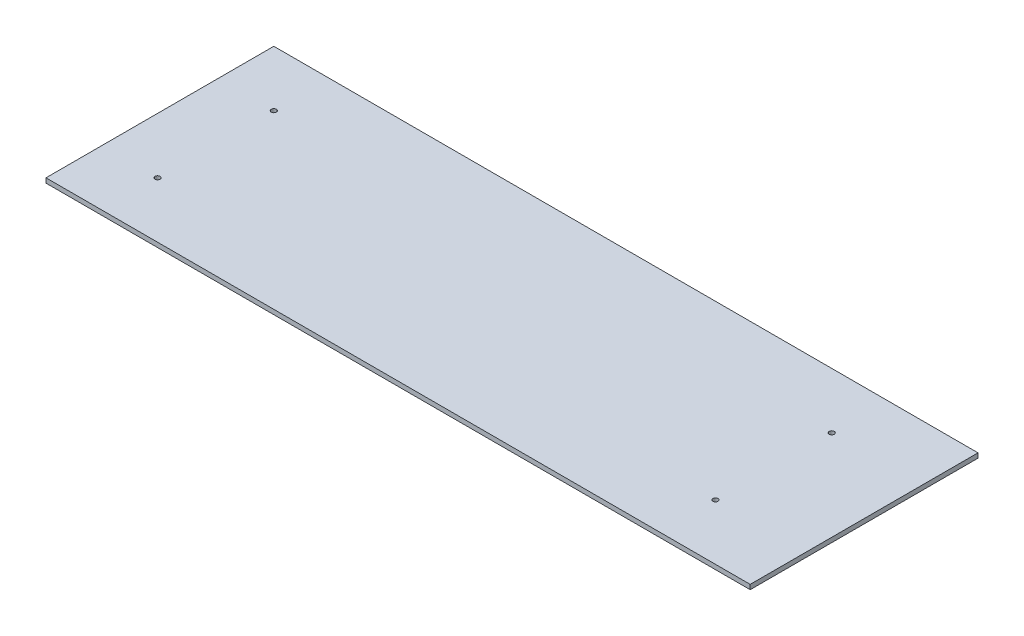
ISO-10303-21;
HEADER;
FILE_DESCRIPTION(('STEP AP214'),'2;1');
FILE_NAME('part.step','',(''),(''),'','','');
FILE_SCHEMA(('AUTOMOTIVE_DESIGN { 1 0 10303 214 1 1 1 1 }'));
ENDSEC;
DATA;
#1=APPLICATION_CONTEXT('core data for automotive mechanical design processes');
#2=APPLICATION_PROTOCOL_DEFINITION('international standard','automotive_design',2000,#1);
#3=PRODUCT_CONTEXT('',#1,'mechanical');
#4=PRODUCT('Part','Part','',(#3));
#5=PRODUCT_RELATED_PRODUCT_CATEGORY('part','',(#4));
#6=PRODUCT_DEFINITION_FORMATION('','',#4);
#7=PRODUCT_DEFINITION_CONTEXT('part definition',#1,'design');
#8=PRODUCT_DEFINITION('design','',#6,#7);
#9=PRODUCT_DEFINITION_SHAPE('','',#8);
#10=(LENGTH_UNIT() NAMED_UNIT(*) SI_UNIT(.MILLI.,.METRE.));
#11=(NAMED_UNIT(*) PLANE_ANGLE_UNIT() SI_UNIT($,.RADIAN.));
#12=(NAMED_UNIT(*) SI_UNIT($,.STERADIAN.) SOLID_ANGLE_UNIT());
#13=UNCERTAINTY_MEASURE_WITH_UNIT(LENGTH_MEASURE(1.E-05),#10,'distance_accuracy_value','');
#14=(GEOMETRIC_REPRESENTATION_CONTEXT(3) GLOBAL_UNCERTAINTY_ASSIGNED_CONTEXT((#13)) GLOBAL_UNIT_ASSIGNED_CONTEXT((#10,
#11,#12)) REPRESENTATION_CONTEXT('',''));
#15=CARTESIAN_POINT('',(0.,0.,0.));
#16=DIRECTION('',(0.,0.,1.));
#17=DIRECTION('',(1.,0.,0.));
#18=AXIS2_PLACEMENT_3D('',#15,#16,#17);
#19=CARTESIAN_POINT('',(0.,6.35,0.));
#20=DIRECTION('',(1.,0.,0.));
#21=DIRECTION('',(0.,0.,-1.));
#22=AXIS2_PLACEMENT_3D('',#19,#20,#21);
#23=PLANE('',#22);
#24=DIRECTION('',(0.,0.,1.));
#25=VECTOR('',#24,1.);
#26=CARTESIAN_POINT('',(0.,0.,0.));
#27=LINE('',#26,#25);
#28=CARTESIAN_POINT('',(0.,0.,-311.15));
#29=VERTEX_POINT('',#28);
#30=CARTESIAN_POINT('',(0.,0.,0.));
#31=VERTEX_POINT('',#30);
#32=EDGE_CURVE('E97',#29,#31,#27,.T.);
#33=ORIENTED_EDGE('',*,*,#32,.T.);
#34=DIRECTION('',(0.,-1.,0.));
#35=VECTOR('',#34,1.);
#36=CARTESIAN_POINT('',(0.,6.35,0.));
#37=LINE('',#36,#35);
#38=CARTESIAN_POINT('',(0.,6.35,0.));
#39=VERTEX_POINT('',#38);
#40=EDGE_CURVE('E11',#39,#31,#37,.T.);
#41=ORIENTED_EDGE('',*,*,#40,.F.);
#42=DIRECTION('',(0.,0.,1.));
#43=VECTOR('',#42,1.);
#44=CARTESIAN_POINT('',(0.,6.35,0.));
#45=LINE('',#44,#43);
#46=CARTESIAN_POINT('',(0.,6.35,-311.15));
#47=VERTEX_POINT('',#46);
#48=EDGE_CURVE('E85',#47,#39,#45,.T.);
#49=ORIENTED_EDGE('',*,*,#48,.F.);
#50=DIRECTION('',(0.,-1.,0.));
#51=VECTOR('',#50,1.);
#52=CARTESIAN_POINT('',(0.,6.35,-311.15));
#53=LINE('',#52,#51);
#54=EDGE_CURVE('E93',#47,#29,#53,.T.);
#55=ORIENTED_EDGE('',*,*,#54,.T.);
#56=EDGE_LOOP('',(#33,#41,#49,#55));
#57=FACE_BOUND('',#56,.T.);
#58=ADVANCED_FACE('F34',(#57),#23,.F.);
#59=CARTESIAN_POINT('',(0.,6.35,0.));
#60=DIRECTION('',(0.,0.,-1.));
#61=DIRECTION('',(-1.,0.,0.));
#62=AXIS2_PLACEMENT_3D('',#59,#60,#61);
#63=PLANE('',#62);
#64=DIRECTION('',(1.,0.,0.));
#65=VECTOR('',#64,1.);
#66=CARTESIAN_POINT('',(0.,0.,0.));
#67=LINE('',#66,#65);
#68=CARTESIAN_POINT('',(961.792682926829,0.,0.));
#69=VERTEX_POINT('',#68);
#70=EDGE_CURVE('E89',#31,#69,#67,.T.);
#71=ORIENTED_EDGE('',*,*,#70,.T.);
#72=DIRECTION('',(0.,-1.,0.));
#73=VECTOR('',#72,1.);
#74=CARTESIAN_POINT('',(961.792682926829,6.35,0.));
#75=LINE('',#74,#73);
#76=CARTESIAN_POINT('',(961.792682926829,6.35,0.));
#77=VERTEX_POINT('',#76);
#78=EDGE_CURVE('E42',#77,#69,#75,.T.);
#79=ORIENTED_EDGE('',*,*,#78,.F.);
#80=DIRECTION('',(1.,0.,0.));
#81=VECTOR('',#80,1.);
#82=CARTESIAN_POINT('',(0.,6.35,0.));
#83=LINE('',#82,#81);
#84=EDGE_CURVE('E80',#39,#77,#83,.T.);
#85=ORIENTED_EDGE('',*,*,#84,.F.);
#86=ORIENTED_EDGE('',*,*,#40,.T.);
#87=EDGE_LOOP('',(#71,#79,#85,#86));
#88=FACE_BOUND('',#87,.T.);
#89=ADVANCED_FACE('F88',(#88),#63,.F.);
#90=CARTESIAN_POINT('',(961.792682926829,6.35,-311.15));
#91=DIRECTION('',(-1.,0.,0.));
#92=DIRECTION('',(0.,0.,1.));
#93=AXIS2_PLACEMENT_3D('',#90,#91,#92);
#94=PLANE('',#93);
#95=DIRECTION('',(0.,0.,-1.));
#96=VECTOR('',#95,1.);
#97=CARTESIAN_POINT('',(961.792682926829,0.,-311.15));
#98=LINE('',#97,#96);
#99=CARTESIAN_POINT('',(961.792682926829,0.,-311.15));
#100=VERTEX_POINT('',#99);
#101=EDGE_CURVE('E67',#69,#100,#98,.T.);
#102=ORIENTED_EDGE('',*,*,#101,.T.);
#103=DIRECTION('',(0.,-1.,0.));
#104=VECTOR('',#103,1.);
#105=CARTESIAN_POINT('',(961.792682926829,6.35,-311.15));
#106=LINE('',#105,#104);
#107=CARTESIAN_POINT('',(961.792682926829,6.35,-311.15));
#108=VERTEX_POINT('',#107);
#109=EDGE_CURVE('E90',#108,#100,#106,.T.);
#110=ORIENTED_EDGE('',*,*,#109,.F.);
#111=DIRECTION('',(0.,0.,-1.));
#112=VECTOR('',#111,1.);
#113=CARTESIAN_POINT('',(961.792682926829,6.35,-311.15));
#114=LINE('',#113,#112);
#115=EDGE_CURVE('E83',#77,#108,#114,.T.);
#116=ORIENTED_EDGE('',*,*,#115,.F.);
#117=ORIENTED_EDGE('',*,*,#78,.T.);
#118=EDGE_LOOP('',(#102,#110,#116,#117));
#119=FACE_BOUND('',#118,.T.);
#120=ADVANCED_FACE('F91',(#119),#94,.F.);
#121=CARTESIAN_POINT('',(0.,6.35,-311.15));
#122=DIRECTION('',(0.,0.,1.));
#123=DIRECTION('',(1.,0.,0.));
#124=AXIS2_PLACEMENT_3D('',#121,#122,#123);
#125=PLANE('',#124);
#126=DIRECTION('',(-1.,0.,0.));
#127=VECTOR('',#126,1.);
#128=CARTESIAN_POINT('',(0.,0.,-311.15));
#129=LINE('',#128,#127);
#130=EDGE_CURVE('E73',#100,#29,#129,.T.);
#131=ORIENTED_EDGE('',*,*,#130,.T.);
#132=ORIENTED_EDGE('',*,*,#54,.F.);
#133=DIRECTION('',(-1.,0.,0.));
#134=VECTOR('',#133,1.);
#135=CARTESIAN_POINT('',(0.,6.35,-311.15));
#136=LINE('',#135,#134);
#137=EDGE_CURVE('E50',#108,#47,#136,.T.);
#138=ORIENTED_EDGE('',*,*,#137,.F.);
#139=ORIENTED_EDGE('',*,*,#109,.T.);
#140=EDGE_LOOP('',(#131,#132,#138,#139));
#141=FACE_BOUND('',#140,.T.);
#142=ADVANCED_FACE('F105',(#141),#125,.F.);
#143=CARTESIAN_POINT('',(0.,6.35,0.));
#144=DIRECTION('',(0.,-1.,0.));
#145=DIRECTION('',(0.,0.,-1.));
#146=AXIS2_PLACEMENT_3D('',#143,#144,#145);
#147=PLANE('',#146);
#148=CARTESIAN_POINT('',(838.2,6.35,-234.95));
#149=DIRECTION('',(0.,1.,0.));
#150=DIRECTION('',(0.,0.,1.));
#151=AXIS2_PLACEMENT_3D('',#148,#149,#150);
#152=CIRCLE('',#151,3.45439999999997);
#153=CARTESIAN_POINT('',(838.2,6.35,-231.4956));
#154=VERTEX_POINT('',#153);
#155=EDGE_CURVE('E131',#154,#154,#152,.T.);
#156=ORIENTED_EDGE('',*,*,#155,.F.);
#157=EDGE_LOOP('',(#156));
#158=FACE_BOUND('',#157,.T.);
#159=CARTESIAN_POINT('',(838.2,6.35,-76.2));
#160=DIRECTION('',(0.,1.,0.));
#161=DIRECTION('',(0.,0.,1.));
#162=AXIS2_PLACEMENT_3D('',#159,#160,#161);
#163=CIRCLE('',#162,3.45439999999997);
#164=CARTESIAN_POINT('',(838.2,6.35,-72.7456));
#165=VERTEX_POINT('',#164);
#166=EDGE_CURVE('E125',#165,#165,#163,.T.);
#167=ORIENTED_EDGE('',*,*,#166,.F.);
#168=EDGE_LOOP('',(#167));
#169=FACE_BOUND('',#168,.T.);
#170=CARTESIAN_POINT('',(76.2,6.35,-234.95));
#171=DIRECTION('',(0.,1.,0.));
#172=DIRECTION('',(0.,0.,1.));
#173=AXIS2_PLACEMENT_3D('',#170,#171,#172);
#174=CIRCLE('',#173,3.45439999999998);
#175=CARTESIAN_POINT('',(76.2,6.35,-231.4956));
#176=VERTEX_POINT('',#175);
#177=EDGE_CURVE('E119',#176,#176,#174,.T.);
#178=ORIENTED_EDGE('',*,*,#177,.F.);
#179=EDGE_LOOP('',(#178));
#180=FACE_BOUND('',#179,.T.);
#181=CARTESIAN_POINT('',(76.2,6.35,-76.2));
#182=DIRECTION('',(0.,1.,0.));
#183=DIRECTION('',(0.,0.,1.));
#184=AXIS2_PLACEMENT_3D('',#181,#182,#183);
#185=CIRCLE('',#184,3.4544);
#186=CARTESIAN_POINT('',(76.2,6.35,-72.7456));
#187=VERTEX_POINT('',#186);
#188=EDGE_CURVE('E113',#187,#187,#185,.T.);
#189=ORIENTED_EDGE('',*,*,#188,.F.);
#190=EDGE_LOOP('',(#189));
#191=FACE_BOUND('',#190,.T.);
#192=ORIENTED_EDGE('',*,*,#48,.T.);
#193=ORIENTED_EDGE('',*,*,#84,.T.);
#194=ORIENTED_EDGE('',*,*,#115,.T.);
#195=ORIENTED_EDGE('',*,*,#137,.T.);
#196=EDGE_LOOP('',(#192,#193,#194,#195));
#197=FACE_BOUND('',#196,.T.);
#198=ADVANCED_FACE('F81',(#158,#169,#180,#191,#197),#147,.F.);
#199=CARTESIAN_POINT('',(0.,0.,0.));
#200=DIRECTION('',(0.,-1.,0.));
#201=DIRECTION('',(0.,0.,-1.));
#202=AXIS2_PLACEMENT_3D('',#199,#200,#201);
#203=PLANE('',#202);
#204=CARTESIAN_POINT('',(838.2,0.,-234.95));
#205=DIRECTION('',(0.,1.,0.));
#206=DIRECTION('',(0.,0.,1.));
#207=AXIS2_PLACEMENT_3D('',#204,#205,#206);
#208=CIRCLE('',#207,3.45439999999997);
#209=CARTESIAN_POINT('',(838.2,0.,-231.4956));
#210=VERTEX_POINT('',#209);
#211=EDGE_CURVE('E128',#210,#210,#208,.T.);
#212=ORIENTED_EDGE('',*,*,#211,.T.);
#213=EDGE_LOOP('',(#212));
#214=FACE_BOUND('',#213,.T.);
#215=CARTESIAN_POINT('',(838.2,0.,-76.2));
#216=DIRECTION('',(0.,1.,0.));
#217=DIRECTION('',(0.,0.,1.));
#218=AXIS2_PLACEMENT_3D('',#215,#216,#217);
#219=CIRCLE('',#218,3.45439999999997);
#220=CARTESIAN_POINT('',(838.2,0.,-72.7456));
#221=VERTEX_POINT('',#220);
#222=EDGE_CURVE('E122',#221,#221,#219,.T.);
#223=ORIENTED_EDGE('',*,*,#222,.T.);
#224=EDGE_LOOP('',(#223));
#225=FACE_BOUND('',#224,.T.);
#226=CARTESIAN_POINT('',(76.2,0.,-234.95));
#227=DIRECTION('',(0.,1.,0.));
#228=DIRECTION('',(0.,0.,1.));
#229=AXIS2_PLACEMENT_3D('',#226,#227,#228);
#230=CIRCLE('',#229,3.4544);
#231=CARTESIAN_POINT('',(76.2,0.,-231.4956));
#232=VERTEX_POINT('',#231);
#233=EDGE_CURVE('E116',#232,#232,#230,.T.);
#234=ORIENTED_EDGE('',*,*,#233,.T.);
#235=EDGE_LOOP('',(#234));
#236=FACE_BOUND('',#235,.T.);
#237=CARTESIAN_POINT('',(76.2,0.,-76.2));
#238=DIRECTION('',(0.,1.,0.));
#239=DIRECTION('',(0.,0.,1.));
#240=AXIS2_PLACEMENT_3D('',#237,#238,#239);
#241=CIRCLE('',#240,3.4544);
#242=CARTESIAN_POINT('',(76.2,0.,-72.7456));
#243=VERTEX_POINT('',#242);
#244=EDGE_CURVE('E100',#243,#243,#241,.T.);
#245=ORIENTED_EDGE('',*,*,#244,.T.);
#246=EDGE_LOOP('',(#245));
#247=FACE_BOUND('',#246,.T.);
#248=ORIENTED_EDGE('',*,*,#32,.F.);
#249=ORIENTED_EDGE('',*,*,#130,.F.);
#250=ORIENTED_EDGE('',*,*,#101,.F.);
#251=ORIENTED_EDGE('',*,*,#70,.F.);
#252=EDGE_LOOP('',(#248,#249,#250,#251));
#253=FACE_BOUND('',#252,.T.);
#254=ADVANCED_FACE('F108',(#214,#225,#236,#247,#253),#203,.T.);
#255=CARTESIAN_POINT('',(76.2,6.35,-76.2));
#256=DIRECTION('',(0.,1.,0.));
#257=DIRECTION('',(0.,0.,1.));
#258=AXIS2_PLACEMENT_3D('',#255,#256,#257);
#259=CYLINDRICAL_SURFACE('',#258,3.4544);
#260=ORIENTED_EDGE('',*,*,#244,.F.);
#261=EDGE_LOOP('',(#260));
#262=FACE_BOUND('',#261,.T.);
#263=ORIENTED_EDGE('',*,*,#188,.T.);
#264=EDGE_LOOP('',(#263));
#265=FACE_BOUND('',#264,.T.);
#266=ADVANCED_FACE('F146',(#262,#265),#259,.F.);
#267=CARTESIAN_POINT('',(76.2,6.35,-234.95));
#268=DIRECTION('',(0.,1.,0.));
#269=DIRECTION('',(0.,0.,1.));
#270=AXIS2_PLACEMENT_3D('',#267,#268,#269);
#271=CYLINDRICAL_SURFACE('',#270,3.45439999999999);
#272=ORIENTED_EDGE('',*,*,#233,.F.);
#273=EDGE_LOOP('',(#272));
#274=FACE_BOUND('',#273,.T.);
#275=ORIENTED_EDGE('',*,*,#177,.T.);
#276=EDGE_LOOP('',(#275));
#277=FACE_BOUND('',#276,.T.);
#278=ADVANCED_FACE('F148',(#274,#277),#271,.F.);
#279=CARTESIAN_POINT('',(838.2,6.35,-76.2));
#280=DIRECTION('',(0.,1.,0.));
#281=DIRECTION('',(0.,0.,1.));
#282=AXIS2_PLACEMENT_3D('',#279,#280,#281);
#283=CYLINDRICAL_SURFACE('',#282,3.45439999999997);
#284=ORIENTED_EDGE('',*,*,#222,.F.);
#285=EDGE_LOOP('',(#284));
#286=FACE_BOUND('',#285,.T.);
#287=ORIENTED_EDGE('',*,*,#166,.T.);
#288=EDGE_LOOP('',(#287));
#289=FACE_BOUND('',#288,.T.);
#290=ADVANCED_FACE('F155',(#286,#289),#283,.F.);
#291=CARTESIAN_POINT('',(838.2,6.35,-234.95));
#292=DIRECTION('',(0.,1.,0.));
#293=DIRECTION('',(0.,0.,1.));
#294=AXIS2_PLACEMENT_3D('',#291,#292,#293);
#295=CYLINDRICAL_SURFACE('',#294,3.45439999999997);
#296=ORIENTED_EDGE('',*,*,#211,.F.);
#297=EDGE_LOOP('',(#296));
#298=FACE_BOUND('',#297,.T.);
#299=ORIENTED_EDGE('',*,*,#155,.T.);
#300=EDGE_LOOP('',(#299));
#301=FACE_BOUND('',#300,.T.);
#302=ADVANCED_FACE('F135',(#298,#301),#295,.F.);
#303=CLOSED_SHELL('',(#58,#89,#120,#142,#198,#254,#266,#278,#290,#302));
#304=MANIFOLD_SOLID_BREP('B2',#303);
#305=ADVANCED_BREP_SHAPE_REPRESENTATION('',(#18,#304),#14);
#306=SHAPE_DEFINITION_REPRESENTATION(#9,#305);
ENDSEC;
END-ISO-10303-21;
